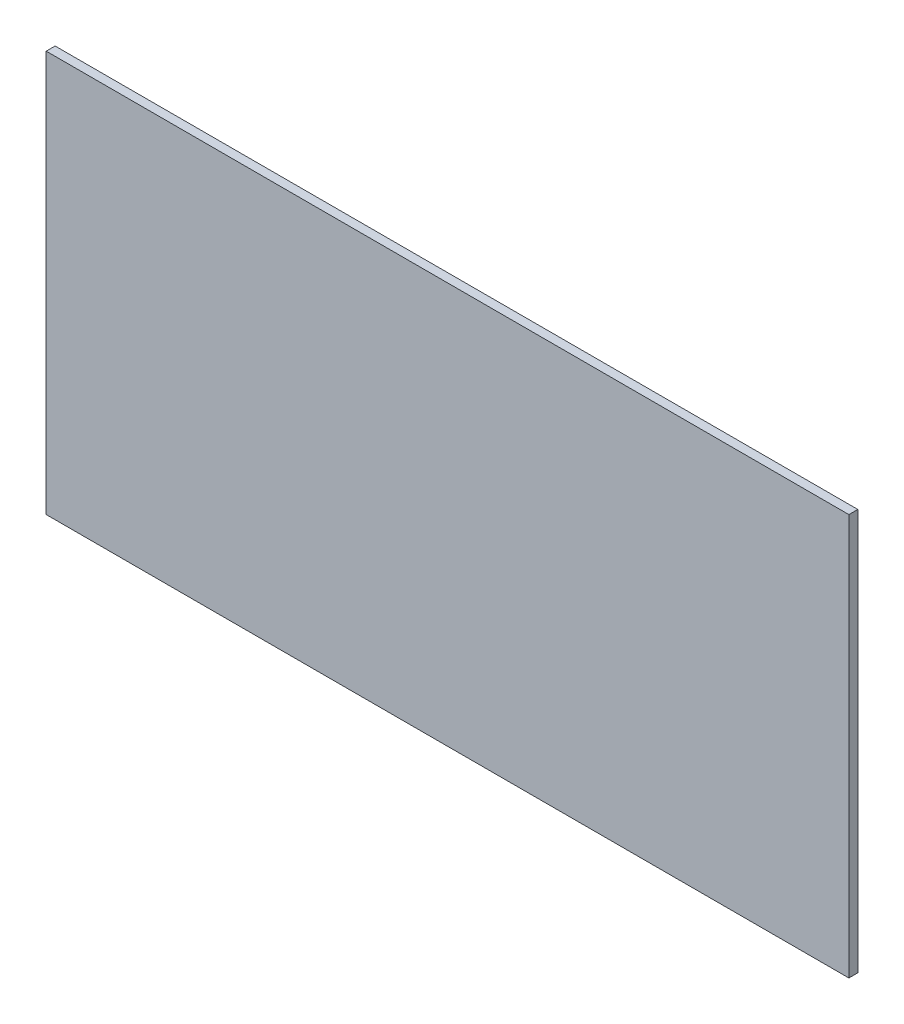
ISO-10303-21;
HEADER;
FILE_DESCRIPTION(('STEP AP214'),'2;1');
FILE_NAME('part.step','',(''),(''),'','','');
FILE_SCHEMA(('AUTOMOTIVE_DESIGN { 1 0 10303 214 1 1 1 1 }'));
ENDSEC;
DATA;
#1=APPLICATION_CONTEXT('core data for automotive mechanical design processes');
#2=APPLICATION_PROTOCOL_DEFINITION('international standard','automotive_design',2000,#1);
#3=PRODUCT_CONTEXT('',#1,'mechanical');
#4=PRODUCT('Part','Part','',(#3));
#5=PRODUCT_RELATED_PRODUCT_CATEGORY('part','',(#4));
#6=PRODUCT_DEFINITION_FORMATION('','',#4);
#7=PRODUCT_DEFINITION_CONTEXT('part definition',#1,'design');
#8=PRODUCT_DEFINITION('design','',#6,#7);
#9=PRODUCT_DEFINITION_SHAPE('','',#8);
#10=(LENGTH_UNIT() NAMED_UNIT(*) SI_UNIT(.MILLI.,.METRE.));
#11=(NAMED_UNIT(*) PLANE_ANGLE_UNIT() SI_UNIT($,.RADIAN.));
#12=(NAMED_UNIT(*) SI_UNIT($,.STERADIAN.) SOLID_ANGLE_UNIT());
#13=UNCERTAINTY_MEASURE_WITH_UNIT(LENGTH_MEASURE(1.E-05),#10,'distance_accuracy_value','');
#14=(GEOMETRIC_REPRESENTATION_CONTEXT(3) GLOBAL_UNCERTAINTY_ASSIGNED_CONTEXT((#13)) GLOBAL_UNIT_ASSIGNED_CONTEXT((#10,
#11,#12)) REPRESENTATION_CONTEXT('',''));
#15=CARTESIAN_POINT('',(0.,0.,0.));
#16=DIRECTION('',(0.,0.,1.));
#17=DIRECTION('',(1.,0.,0.));
#18=AXIS2_PLACEMENT_3D('',#15,#16,#17);
#19=CARTESIAN_POINT('',(90.,-45.,2.));
#20=DIRECTION('',(-1.,0.,0.));
#21=DIRECTION('',(0.,0.,1.));
#22=AXIS2_PLACEMENT_3D('',#19,#20,#21);
#23=PLANE('',#22);
#24=DIRECTION('',(0.,1.,0.));
#25=VECTOR('',#24,1.);
#26=CARTESIAN_POINT('',(90.,-45.,0.));
#27=LINE('',#26,#25);
#28=CARTESIAN_POINT('',(90.,-45.,0.));
#29=VERTEX_POINT('',#28);
#30=CARTESIAN_POINT('',(90.,45.,0.));
#31=VERTEX_POINT('',#30);
#32=EDGE_CURVE('E97',#29,#31,#27,.T.);
#33=ORIENTED_EDGE('',*,*,#32,.T.);
#34=DIRECTION('',(0.,0.,-1.));
#35=VECTOR('',#34,1.);
#36=CARTESIAN_POINT('',(90.,45.,2.));
#37=LINE('',#36,#35);
#38=CARTESIAN_POINT('',(90.,45.,2.));
#39=VERTEX_POINT('',#38);
#40=EDGE_CURVE('E11',#39,#31,#37,.T.);
#41=ORIENTED_EDGE('',*,*,#40,.F.);
#42=DIRECTION('',(0.,1.,0.));
#43=VECTOR('',#42,1.);
#44=CARTESIAN_POINT('',(90.,-45.,2.));
#45=LINE('',#44,#43);
#46=CARTESIAN_POINT('',(90.,-45.,2.));
#47=VERTEX_POINT('',#46);
#48=EDGE_CURVE('E85',#47,#39,#45,.T.);
#49=ORIENTED_EDGE('',*,*,#48,.F.);
#50=DIRECTION('',(0.,0.,-1.));
#51=VECTOR('',#50,1.);
#52=CARTESIAN_POINT('',(90.,-45.,2.));
#53=LINE('',#52,#51);
#54=EDGE_CURVE('E93',#47,#29,#53,.T.);
#55=ORIENTED_EDGE('',*,*,#54,.T.);
#56=EDGE_LOOP('',(#33,#41,#49,#55));
#57=FACE_BOUND('',#56,.T.);
#58=ADVANCED_FACE('F34',(#57),#23,.F.);
#59=CARTESIAN_POINT('',(-90.,45.,2.));
#60=DIRECTION('',(0.,-1.,0.));
#61=DIRECTION('',(0.,0.,-1.));
#62=AXIS2_PLACEMENT_3D('',#59,#60,#61);
#63=PLANE('',#62);
#64=DIRECTION('',(-1.,0.,0.));
#65=VECTOR('',#64,1.);
#66=CARTESIAN_POINT('',(-90.,45.,0.));
#67=LINE('',#66,#65);
#68=CARTESIAN_POINT('',(-90.,45.,0.));
#69=VERTEX_POINT('',#68);
#70=EDGE_CURVE('E89',#31,#69,#67,.T.);
#71=ORIENTED_EDGE('',*,*,#70,.T.);
#72=DIRECTION('',(0.,0.,-1.));
#73=VECTOR('',#72,1.);
#74=CARTESIAN_POINT('',(-90.,45.,2.));
#75=LINE('',#74,#73);
#76=CARTESIAN_POINT('',(-90.,45.,2.));
#77=VERTEX_POINT('',#76);
#78=EDGE_CURVE('E42',#77,#69,#75,.T.);
#79=ORIENTED_EDGE('',*,*,#78,.F.);
#80=DIRECTION('',(-1.,0.,0.));
#81=VECTOR('',#80,1.);
#82=CARTESIAN_POINT('',(-90.,45.,2.));
#83=LINE('',#82,#81);
#84=EDGE_CURVE('E80',#39,#77,#83,.T.);
#85=ORIENTED_EDGE('',*,*,#84,.F.);
#86=ORIENTED_EDGE('',*,*,#40,.T.);
#87=EDGE_LOOP('',(#71,#79,#85,#86));
#88=FACE_BOUND('',#87,.T.);
#89=ADVANCED_FACE('F88',(#88),#63,.F.);
#90=CARTESIAN_POINT('',(-90.,-45.,2.));
#91=DIRECTION('',(1.,0.,0.));
#92=DIRECTION('',(0.,0.,-1.));
#93=AXIS2_PLACEMENT_3D('',#90,#91,#92);
#94=PLANE('',#93);
#95=DIRECTION('',(0.,-1.,0.));
#96=VECTOR('',#95,1.);
#97=CARTESIAN_POINT('',(-90.,-45.,0.));
#98=LINE('',#97,#96);
#99=CARTESIAN_POINT('',(-90.,-45.,0.));
#100=VERTEX_POINT('',#99);
#101=EDGE_CURVE('E67',#69,#100,#98,.T.);
#102=ORIENTED_EDGE('',*,*,#101,.T.);
#103=DIRECTION('',(0.,0.,-1.));
#104=VECTOR('',#103,1.);
#105=CARTESIAN_POINT('',(-90.,-45.,2.));
#106=LINE('',#105,#104);
#107=CARTESIAN_POINT('',(-90.,-45.,2.));
#108=VERTEX_POINT('',#107);
#109=EDGE_CURVE('E90',#108,#100,#106,.T.);
#110=ORIENTED_EDGE('',*,*,#109,.F.);
#111=DIRECTION('',(0.,-1.,0.));
#112=VECTOR('',#111,1.);
#113=CARTESIAN_POINT('',(-90.,-45.,2.));
#114=LINE('',#113,#112);
#115=EDGE_CURVE('E83',#77,#108,#114,.T.);
#116=ORIENTED_EDGE('',*,*,#115,.F.);
#117=ORIENTED_EDGE('',*,*,#78,.T.);
#118=EDGE_LOOP('',(#102,#110,#116,#117));
#119=FACE_BOUND('',#118,.T.);
#120=ADVANCED_FACE('F91',(#119),#94,.F.);
#121=CARTESIAN_POINT('',(-90.,-45.,2.));
#122=DIRECTION('',(0.,1.,0.));
#123=DIRECTION('',(0.,0.,1.));
#124=AXIS2_PLACEMENT_3D('',#121,#122,#123);
#125=PLANE('',#124);
#126=DIRECTION('',(1.,0.,0.));
#127=VECTOR('',#126,1.);
#128=CARTESIAN_POINT('',(-90.,-45.,0.));
#129=LINE('',#128,#127);
#130=EDGE_CURVE('E73',#100,#29,#129,.T.);
#131=ORIENTED_EDGE('',*,*,#130,.T.);
#132=ORIENTED_EDGE('',*,*,#54,.F.);
#133=DIRECTION('',(1.,0.,0.));
#134=VECTOR('',#133,1.);
#135=CARTESIAN_POINT('',(-90.,-45.,2.));
#136=LINE('',#135,#134);
#137=EDGE_CURVE('E50',#108,#47,#136,.T.);
#138=ORIENTED_EDGE('',*,*,#137,.F.);
#139=ORIENTED_EDGE('',*,*,#109,.T.);
#140=EDGE_LOOP('',(#131,#132,#138,#139));
#141=FACE_BOUND('',#140,.T.);
#142=ADVANCED_FACE('F104',(#141),#125,.F.);
#143=CARTESIAN_POINT('',(0.,0.,2.));
#144=DIRECTION('',(0.,0.,-1.));
#145=DIRECTION('',(-1.,0.,0.));
#146=AXIS2_PLACEMENT_3D('',#143,#144,#145);
#147=PLANE('',#146);
#148=ORIENTED_EDGE('',*,*,#48,.T.);
#149=ORIENTED_EDGE('',*,*,#84,.T.);
#150=ORIENTED_EDGE('',*,*,#115,.T.);
#151=ORIENTED_EDGE('',*,*,#137,.T.);
#152=EDGE_LOOP('',(#148,#149,#150,#151));
#153=FACE_BOUND('',#152,.T.);
#154=ADVANCED_FACE('F81',(#153),#147,.F.);
#155=CARTESIAN_POINT('',(0.,0.,0.));
#156=DIRECTION('',(0.,0.,-1.));
#157=DIRECTION('',(-1.,0.,0.));
#158=AXIS2_PLACEMENT_3D('',#155,#156,#157);
#159=PLANE('',#158);
#160=ORIENTED_EDGE('',*,*,#32,.F.);
#161=ORIENTED_EDGE('',*,*,#130,.F.);
#162=ORIENTED_EDGE('',*,*,#101,.F.);
#163=ORIENTED_EDGE('',*,*,#70,.F.);
#164=EDGE_LOOP('',(#160,#161,#162,#163));
#165=FACE_BOUND('',#164,.T.);
#166=ADVANCED_FACE('F107',(#165),#159,.T.);
#167=CLOSED_SHELL('',(#58,#89,#120,#142,#154,#166));
#168=MANIFOLD_SOLID_BREP('B2',#167);
#169=ADVANCED_BREP_SHAPE_REPRESENTATION('',(#18,#168),#14);
#170=SHAPE_DEFINITION_REPRESENTATION(#9,#169);
ENDSEC;
END-ISO-10303-21;
